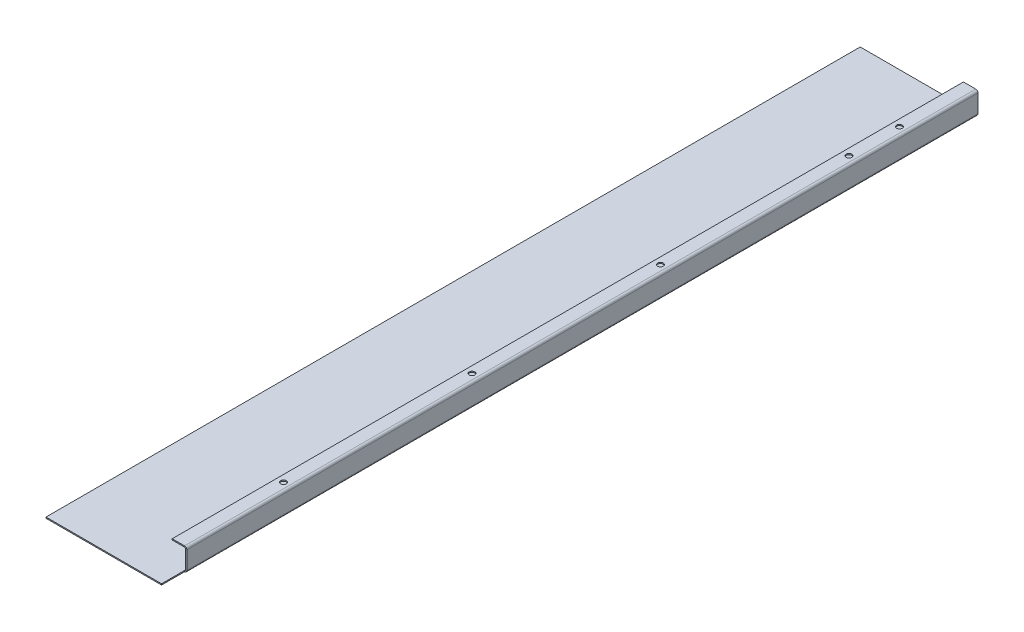
ISO-10303-21;
HEADER;
FILE_DESCRIPTION(('STEP AP214'),'2;1');
FILE_NAME('part.step','',(''),(''),'','','');
FILE_SCHEMA(('AUTOMOTIVE_DESIGN { 1 0 10303 214 1 1 1 1 }'));
ENDSEC;
DATA;
#1=APPLICATION_CONTEXT('core data for automotive mechanical design processes');
#2=APPLICATION_PROTOCOL_DEFINITION('international standard','automotive_design',2000,#1);
#3=PRODUCT_CONTEXT('',#1,'mechanical');
#4=PRODUCT('Part','Part','',(#3));
#5=PRODUCT_RELATED_PRODUCT_CATEGORY('part','',(#4));
#6=PRODUCT_DEFINITION_FORMATION('','',#4);
#7=PRODUCT_DEFINITION_CONTEXT('part definition',#1,'design');
#8=PRODUCT_DEFINITION('design','',#6,#7);
#9=PRODUCT_DEFINITION_SHAPE('','',#8);
#10=(LENGTH_UNIT() NAMED_UNIT(*) SI_UNIT(.MILLI.,.METRE.));
#11=(NAMED_UNIT(*) PLANE_ANGLE_UNIT() SI_UNIT($,.RADIAN.));
#12=(NAMED_UNIT(*) SI_UNIT($,.STERADIAN.) SOLID_ANGLE_UNIT());
#13=UNCERTAINTY_MEASURE_WITH_UNIT(LENGTH_MEASURE(1.E-05),#10,'distance_accuracy_value','');
#14=(GEOMETRIC_REPRESENTATION_CONTEXT(3) GLOBAL_UNCERTAINTY_ASSIGNED_CONTEXT((#13)) GLOBAL_UNIT_ASSIGNED_CONTEXT((#10,
#11,#12)) REPRESENTATION_CONTEXT('',''));
#15=CARTESIAN_POINT('',(0.,0.,0.));
#16=DIRECTION('',(0.,0.,1.));
#17=DIRECTION('',(1.,0.,0.));
#18=AXIS2_PLACEMENT_3D('',#15,#16,#17);
#19=CARTESIAN_POINT('',(105.,-3.86956670765295E-13,0.));
#20=DIRECTION('',(-1.,0.,0.));
#21=DIRECTION('',(0.,-1.,0.));
#22=AXIS2_PLACEMENT_3D('',#19,#20,#21);
#23=PLANE('',#22);
#24=DIRECTION('',(0.,-1.,0.));
#25=VECTOR('',#24,1.);
#26=CARTESIAN_POINT('',(105.,-3.87117238849561E-13,-20.5));
#27=LINE('',#26,#25);
#28=CARTESIAN_POINT('',(105.,17.,-20.5));
#29=VERTEX_POINT('',#28);
#30=CARTESIAN_POINT('',(105.,0.999999999999969,-20.5));
#31=VERTEX_POINT('',#30);
#32=EDGE_CURVE('E359',#29,#31,#27,.T.);
#33=ORIENTED_EDGE('',*,*,#32,.T.);
#34=DIRECTION('',(0.,0.,-1.));
#35=VECTOR('',#34,1.);
#36=CARTESIAN_POINT('',(105.,0.999999999999997,0.));
#37=LINE('',#36,#35);
#38=CARTESIAN_POINT('',(105.,0.999999999999969,-725.7));
#39=VERTEX_POINT('',#38);
#40=EDGE_CURVE('E237',#39,#31,#37,.F.);
#41=ORIENTED_EDGE('',*,*,#40,.F.);
#42=DIRECTION('',(0.,1.,0.));
#43=VECTOR('',#42,1.);
#44=CARTESIAN_POINT('',(105.,-3.86956670765295E-13,-725.7));
#45=LINE('',#44,#43);
#46=CARTESIAN_POINT('',(105.,17.,-725.7));
#47=VERTEX_POINT('',#46);
#48=EDGE_CURVE('E232',#39,#47,#45,.T.);
#49=ORIENTED_EDGE('',*,*,#48,.T.);
#50=DIRECTION('',(0.,0.,-1.));
#51=VECTOR('',#50,1.);
#52=CARTESIAN_POINT('',(105.,17.,-725.7));
#53=LINE('',#52,#51);
#54=EDGE_CURVE('E220',#47,#29,#53,.F.);
#55=ORIENTED_EDGE('',*,*,#54,.T.);
#56=EDGE_LOOP('',(#33,#41,#49,#55));
#57=FACE_BOUND('',#56,.T.);
#58=ADVANCED_FACE('F78',(#57),#23,.F.);
#59=CARTESIAN_POINT('',(104.,-3.83465189426452E-13,0.));
#60=DIRECTION('',(-1.,0.,0.));
#61=DIRECTION('',(0.,-1.,0.));
#62=AXIS2_PLACEMENT_3D('',#59,#60,#61);
#63=PLANE('',#62);
#64=DIRECTION('',(0.,0.,-1.));
#65=VECTOR('',#64,1.);
#66=CARTESIAN_POINT('',(104.,1.,0.));
#67=LINE('',#66,#65);
#68=CARTESIAN_POINT('',(104.,0.999999999999973,-20.5));
#69=VERTEX_POINT('',#68);
#70=CARTESIAN_POINT('',(104.,0.999999999999987,-725.7));
#71=VERTEX_POINT('',#70);
#72=EDGE_CURVE('E231',#69,#71,#67,.T.);
#73=ORIENTED_EDGE('',*,*,#72,.F.);
#74=DIRECTION('',(0.,-1.,0.));
#75=VECTOR('',#74,1.);
#76=CARTESIAN_POINT('',(104.,-3.83465189426452E-13,-20.5));
#77=LINE('',#76,#75);
#78=CARTESIAN_POINT('',(104.,17.,-20.5));
#79=VERTEX_POINT('',#78);
#80=EDGE_CURVE('E360',#79,#69,#77,.T.);
#81=ORIENTED_EDGE('',*,*,#80,.F.);
#82=DIRECTION('',(0.,0.,-1.));
#83=VECTOR('',#82,1.);
#84=CARTESIAN_POINT('',(104.,17.,-725.7));
#85=LINE('',#84,#83);
#86=CARTESIAN_POINT('',(104.,17.,-725.7));
#87=VERTEX_POINT('',#86);
#88=EDGE_CURVE('E103',#87,#79,#85,.F.);
#89=ORIENTED_EDGE('',*,*,#88,.F.);
#90=DIRECTION('',(0.,-1.,0.));
#91=VECTOR('',#90,1.);
#92=CARTESIAN_POINT('',(104.,19.,-725.7));
#93=LINE('',#92,#91);
#94=EDGE_CURVE('E235',#71,#87,#93,.F.);
#95=ORIENTED_EDGE('',*,*,#94,.F.);
#96=EDGE_LOOP('',(#73,#81,#89,#95));
#97=FACE_BOUND('',#96,.T.);
#98=ADVANCED_FACE('F377',(#97),#63,.T.);
#99=CARTESIAN_POINT('',(103.,0.999999999999991,-725.7));
#100=DIRECTION('',(0.,0.,-1.));
#101=DIRECTION('',(1.,0.,0.));
#102=AXIS2_PLACEMENT_3D('',#99,#100,#101);
#103=CYLINDRICAL_SURFACE('',#102,2.00000000000006);
#104=ORIENTED_EDGE('',*,*,#40,.T.);
#105=CARTESIAN_POINT('',(103.,0.999999999999934,-20.5000000000004));
#106=DIRECTION('',(0.,0.,-1.));
#107=DIRECTION('',(-1.,0.,0.));
#108=AXIS2_PLACEMENT_3D('',#105,#106,#107);
#109=CIRCLE('',#108,2.);
#110=CARTESIAN_POINT('',(103.,-1.00000000000007,-20.5000000000004));
#111=VERTEX_POINT('',#110);
#112=EDGE_CURVE('E332',#31,#111,#109,.T.);
#113=ORIENTED_EDGE('',*,*,#112,.T.);
#114=DIRECTION('',(0.,0.,-1.));
#115=VECTOR('',#114,1.);
#116=CARTESIAN_POINT('',(103.,-1.00000000000007,-725.7));
#117=LINE('',#116,#115);
#118=CARTESIAN_POINT('',(103.,-1.00000000000007,-725.7));
#119=VERTEX_POINT('',#118);
#120=EDGE_CURVE('E244',#119,#111,#117,.F.);
#121=ORIENTED_EDGE('',*,*,#120,.F.);
#122=CARTESIAN_POINT('',(103.,0.999999999999991,-725.7));
#123=DIRECTION('',(0.,0.,-1.));
#124=DIRECTION('',(-1.,0.,0.));
#125=AXIS2_PLACEMENT_3D('',#122,#123,#124);
#126=CIRCLE('',#125,2.00000000000006);
#127=EDGE_CURVE('E248',#39,#119,#126,.T.);
#128=ORIENTED_EDGE('',*,*,#127,.F.);
#129=EDGE_LOOP('',(#104,#113,#121,#128));
#130=FACE_BOUND('',#129,.T.);
#131=ADVANCED_FACE('F383',(#130),#103,.T.);
#132=CARTESIAN_POINT('',(103.,0.999999999999991,-725.7));
#133=DIRECTION('',(0.,0.,-1.));
#134=DIRECTION('',(1.,0.,0.));
#135=AXIS2_PLACEMENT_3D('',#132,#133,#134);
#136=CYLINDRICAL_SURFACE('',#135,1.00000000000006);
#137=CARTESIAN_POINT('',(103.,0.999999999999934,-20.5000000000009));
#138=DIRECTION('',(0.,0.,1.));
#139=DIRECTION('',(1.,0.,0.));
#140=AXIS2_PLACEMENT_3D('',#137,#138,#139);
#141=CIRCLE('',#140,1.);
#142=CARTESIAN_POINT('',(103.,0.,-20.5));
#143=VERTEX_POINT('',#142);
#144=EDGE_CURVE('E345',#69,#143,#141,.F.);
#145=ORIENTED_EDGE('',*,*,#144,.F.);
#146=ORIENTED_EDGE('',*,*,#72,.T.);
#147=CARTESIAN_POINT('',(103.,0.999999999999991,-725.7));
#148=DIRECTION('',(0.,0.,-1.));
#149=DIRECTION('',(-1.,0.,0.));
#150=AXIS2_PLACEMENT_3D('',#147,#148,#149);
#151=CIRCLE('',#150,1.00000000000006);
#152=CARTESIAN_POINT('',(103.,0.,-725.7));
#153=VERTEX_POINT('',#152);
#154=EDGE_CURVE('E234',#71,#153,#151,.T.);
#155=ORIENTED_EDGE('',*,*,#154,.T.);
#156=DIRECTION('',(0.,0.,-1.));
#157=VECTOR('',#156,1.);
#158=CARTESIAN_POINT('',(103.,0.,-725.7));
#159=LINE('',#158,#157);
#160=EDGE_CURVE('E251',#153,#143,#159,.F.);
#161=ORIENTED_EDGE('',*,*,#160,.T.);
#162=EDGE_LOOP('',(#145,#146,#155,#161));
#163=FACE_BOUND('',#162,.T.);
#164=ADVANCED_FACE('F390',(#163),#136,.F.);
#165=CARTESIAN_POINT('',(103.,17.,-725.7));
#166=DIRECTION('',(0.,0.,-1.));
#167=DIRECTION('',(0.,1.,0.));
#168=AXIS2_PLACEMENT_3D('',#165,#166,#167);
#169=CYLINDRICAL_SURFACE('',#168,2.);
#170=DIRECTION('',(0.,0.,-1.));
#171=VECTOR('',#170,1.);
#172=CARTESIAN_POINT('',(103.,19.,0.));
#173=LINE('',#172,#171);
#174=CARTESIAN_POINT('',(103.,19.,-725.7));
#175=VERTEX_POINT('',#174);
#176=CARTESIAN_POINT('',(103.,19.,-20.5));
#177=VERTEX_POINT('',#176);
#178=EDGE_CURVE('E200',#175,#177,#173,.F.);
#179=ORIENTED_EDGE('',*,*,#178,.T.);
#180=CARTESIAN_POINT('',(103.,17.,-20.5000000000004));
#181=DIRECTION('',(0.,0.,-1.));
#182=DIRECTION('',(-1.,0.,0.));
#183=AXIS2_PLACEMENT_3D('',#180,#181,#182);
#184=CIRCLE('',#183,2.);
#185=EDGE_CURVE('E184',#177,#29,#184,.T.);
#186=ORIENTED_EDGE('',*,*,#185,.T.);
#187=ORIENTED_EDGE('',*,*,#54,.F.);
#188=CARTESIAN_POINT('',(103.,17.,-725.7));
#189=DIRECTION('',(0.,0.,-1.));
#190=DIRECTION('',(-1.,0.,0.));
#191=AXIS2_PLACEMENT_3D('',#188,#189,#190);
#192=CIRCLE('',#191,2.);
#193=EDGE_CURVE('E208',#175,#47,#192,.T.);
#194=ORIENTED_EDGE('',*,*,#193,.F.);
#195=EDGE_LOOP('',(#179,#186,#187,#194));
#196=FACE_BOUND('',#195,.T.);
#197=ADVANCED_FACE('F206',(#196),#169,.T.);
#198=CARTESIAN_POINT('',(103.,17.,-725.7));
#199=DIRECTION('',(0.,0.,-1.));
#200=DIRECTION('',(0.,1.,0.));
#201=AXIS2_PLACEMENT_3D('',#198,#199,#200);
#202=CYLINDRICAL_SURFACE('',#201,1.);
#203=CARTESIAN_POINT('',(103.,17.,-20.5000000000009));
#204=DIRECTION('',(0.,0.,1.));
#205=DIRECTION('',(1.,0.,0.));
#206=AXIS2_PLACEMENT_3D('',#203,#204,#205);
#207=CIRCLE('',#206,1.);
#208=CARTESIAN_POINT('',(103.,18.,-20.5));
#209=VERTEX_POINT('',#208);
#210=EDGE_CURVE('E194',#209,#79,#207,.F.);
#211=ORIENTED_EDGE('',*,*,#210,.F.);
#212=DIRECTION('',(0.,0.,-1.));
#213=VECTOR('',#212,1.);
#214=CARTESIAN_POINT('',(103.,18.,0.));
#215=LINE('',#214,#213);
#216=CARTESIAN_POINT('',(103.,18.,-725.7));
#217=VERTEX_POINT('',#216);
#218=EDGE_CURVE('E215',#209,#217,#215,.T.);
#219=ORIENTED_EDGE('',*,*,#218,.T.);
#220=CARTESIAN_POINT('',(103.,17.,-725.7));
#221=DIRECTION('',(0.,0.,-1.));
#222=DIRECTION('',(-1.,0.,0.));
#223=AXIS2_PLACEMENT_3D('',#220,#221,#222);
#224=CIRCLE('',#223,1.);
#225=EDGE_CURVE('E225',#217,#87,#224,.T.);
#226=ORIENTED_EDGE('',*,*,#225,.T.);
#227=ORIENTED_EDGE('',*,*,#88,.T.);
#228=EDGE_LOOP('',(#211,#219,#226,#227));
#229=FACE_BOUND('',#228,.T.);
#230=ADVANCED_FACE('F314',(#229),#202,.F.);
#231=CARTESIAN_POINT('',(1.40823756520346E-13,19.0000000000008,0.));
#232=DIRECTION('',(0.,-1.,0.));
#233=DIRECTION('',(1.,0.,0.));
#234=AXIS2_PLACEMENT_3D('',#231,#232,#233);
#235=PLANE('',#234);
#236=CARTESIAN_POINT('',(98.0000000000124,19.,-113.7));
#237=DIRECTION('',(0.,1.,0.));
#238=DIRECTION('',(-1.,0.,0.));
#239=AXIS2_PLACEMENT_3D('',#236,#237,#238);
#240=CIRCLE('',#239,2.50000000000001);
#241=CARTESIAN_POINT('',(95.5000000000124,19.0000000000001,-113.7));
#242=VERTEX_POINT('',#241);
#243=EDGE_CURVE('E328',#242,#242,#240,.T.);
#244=ORIENTED_EDGE('',*,*,#243,.F.);
#245=EDGE_LOOP('',(#244));
#246=FACE_BOUND('',#245,.T.);
#247=CARTESIAN_POINT('',(98.0000000000083,19.,-281.7));
#248=DIRECTION('',(0.,1.,0.));
#249=DIRECTION('',(-1.,0.,0.));
#250=AXIS2_PLACEMENT_3D('',#247,#248,#249);
#251=CIRCLE('',#250,2.50000000000001);
#252=CARTESIAN_POINT('',(95.5000000000083,19.0000000000001,-281.7));
#253=VERTEX_POINT('',#252);
#254=EDGE_CURVE('E331',#253,#253,#251,.T.);
#255=ORIENTED_EDGE('',*,*,#254,.F.);
#256=EDGE_LOOP('',(#255));
#257=FACE_BOUND('',#256,.T.);
#258=CARTESIAN_POINT('',(98.0000000000041,19.,-449.7));
#259=DIRECTION('',(0.,1.,0.));
#260=DIRECTION('',(-1.,0.,0.));
#261=AXIS2_PLACEMENT_3D('',#258,#259,#260);
#262=CIRCLE('',#261,2.5);
#263=CARTESIAN_POINT('',(95.5000000000041,19.0000000000001,-449.7));
#264=VERTEX_POINT('',#263);
#265=EDGE_CURVE('E335',#264,#264,#262,.T.);
#266=ORIENTED_EDGE('',*,*,#265,.F.);
#267=EDGE_LOOP('',(#266));
#268=FACE_BOUND('',#267,.T.);
#269=CARTESIAN_POINT('',(98.,19.,-617.7));
#270=DIRECTION('',(0.,1.,0.));
#271=DIRECTION('',(-1.,0.,0.));
#272=AXIS2_PLACEMENT_3D('',#269,#270,#271);
#273=CIRCLE('',#272,2.50000000000001);
#274=CARTESIAN_POINT('',(95.5,19.0000000000001,-617.7));
#275=VERTEX_POINT('',#274);
#276=EDGE_CURVE('E338',#275,#275,#273,.T.);
#277=ORIENTED_EDGE('',*,*,#276,.F.);
#278=EDGE_LOOP('',(#277));
#279=FACE_BOUND('',#278,.T.);
#280=CARTESIAN_POINT('',(98.,19.,-662.7));
#281=DIRECTION('',(0.,1.,0.));
#282=DIRECTION('',(-1.,0.,0.));
#283=AXIS2_PLACEMENT_3D('',#280,#281,#282);
#284=CIRCLE('',#283,2.5);
#285=CARTESIAN_POINT('',(95.5,19.0000000000001,-662.7));
#286=VERTEX_POINT('',#285);
#287=EDGE_CURVE('E281',#286,#286,#284,.T.);
#288=ORIENTED_EDGE('',*,*,#287,.F.);
#289=EDGE_LOOP('',(#288));
#290=FACE_BOUND('',#289,.T.);
#291=DIRECTION('',(1.,0.,0.));
#292=VECTOR('',#291,1.);
#293=CARTESIAN_POINT('',(1.4090824024163E-13,19.0000000000008,-20.5));
#294=LINE('',#293,#292);
#295=CARTESIAN_POINT('',(92.0000000000001,19.0000000000001,-20.5));
#296=VERTEX_POINT('',#295);
#297=EDGE_CURVE('E95',#296,#177,#294,.T.);
#298=ORIENTED_EDGE('',*,*,#297,.T.);
#299=ORIENTED_EDGE('',*,*,#178,.F.);
#300=DIRECTION('',(-1.,0.,0.));
#301=VECTOR('',#300,1.);
#302=CARTESIAN_POINT('',(1.40823756520346E-13,19.0000000000008,-725.7));
#303=LINE('',#302,#301);
#304=CARTESIAN_POINT('',(92.,19.0000000000001,-725.7));
#305=VERTEX_POINT('',#304);
#306=EDGE_CURVE('E322',#175,#305,#303,.T.);
#307=ORIENTED_EDGE('',*,*,#306,.T.);
#308=DIRECTION('',(0.,0.,1.));
#309=VECTOR('',#308,1.);
#310=CARTESIAN_POINT('',(92.0000000000001,19.0000000000001,0.));
#311=LINE('',#310,#309);
#312=EDGE_CURVE('E203',#305,#296,#311,.T.);
#313=ORIENTED_EDGE('',*,*,#312,.T.);
#314=EDGE_LOOP('',(#298,#299,#307,#313));
#315=FACE_BOUND('',#314,.T.);
#316=ADVANCED_FACE('F199',(#246,#257,#268,#279,#290,#315),#235,.F.);
#317=CARTESIAN_POINT('',(1.33680225758394E-13,18.0000000000008,0.));
#318=DIRECTION('',(0.,-1.,0.));
#319=DIRECTION('',(1.,0.,0.));
#320=AXIS2_PLACEMENT_3D('',#317,#318,#319);
#321=PLANE('',#320);
#322=CARTESIAN_POINT('',(98.,18.,-662.7));
#323=DIRECTION('',(0.,-1.,0.));
#324=DIRECTION('',(1.,0.,0.));
#325=AXIS2_PLACEMENT_3D('',#322,#323,#324);
#326=CIRCLE('',#325,2.5);
#327=CARTESIAN_POINT('',(100.5,18.,-662.7));
#328=VERTEX_POINT('',#327);
#329=EDGE_CURVE('E82',#328,#328,#326,.T.);
#330=ORIENTED_EDGE('',*,*,#329,.F.);
#331=EDGE_LOOP('',(#330));
#332=FACE_BOUND('',#331,.T.);
#333=CARTESIAN_POINT('',(98.,18.,-617.7));
#334=DIRECTION('',(0.,-1.,0.));
#335=DIRECTION('',(1.,0.,0.));
#336=AXIS2_PLACEMENT_3D('',#333,#334,#335);
#337=CIRCLE('',#336,2.50000000000001);
#338=CARTESIAN_POINT('',(100.5,18.,-617.7));
#339=VERTEX_POINT('',#338);
#340=EDGE_CURVE('E286',#339,#339,#337,.T.);
#341=ORIENTED_EDGE('',*,*,#340,.F.);
#342=EDGE_LOOP('',(#341));
#343=FACE_BOUND('',#342,.T.);
#344=CARTESIAN_POINT('',(98.0000000000041,18.,-449.7));
#345=DIRECTION('',(0.,-1.,0.));
#346=DIRECTION('',(1.,0.,0.));
#347=AXIS2_PLACEMENT_3D('',#344,#345,#346);
#348=CIRCLE('',#347,2.5);
#349=CARTESIAN_POINT('',(100.500000000004,18.,-449.7));
#350=VERTEX_POINT('',#349);
#351=EDGE_CURVE('E284',#350,#350,#348,.T.);
#352=ORIENTED_EDGE('',*,*,#351,.F.);
#353=EDGE_LOOP('',(#352));
#354=FACE_BOUND('',#353,.T.);
#355=CARTESIAN_POINT('',(98.0000000000083,18.,-281.7));
#356=DIRECTION('',(0.,-1.,0.));
#357=DIRECTION('',(1.,0.,0.));
#358=AXIS2_PLACEMENT_3D('',#355,#356,#357);
#359=CIRCLE('',#358,2.50000000000001);
#360=CARTESIAN_POINT('',(100.500000000008,18.,-281.7));
#361=VERTEX_POINT('',#360);
#362=EDGE_CURVE('E280',#361,#361,#359,.T.);
#363=ORIENTED_EDGE('',*,*,#362,.F.);
#364=EDGE_LOOP('',(#363));
#365=FACE_BOUND('',#364,.T.);
#366=CARTESIAN_POINT('',(98.0000000000124,18.,-113.7));
#367=DIRECTION('',(0.,-1.,0.));
#368=DIRECTION('',(1.,0.,0.));
#369=AXIS2_PLACEMENT_3D('',#366,#367,#368);
#370=CIRCLE('',#369,2.50000000000001);
#371=CARTESIAN_POINT('',(100.500000000012,18.,-113.7));
#372=VERTEX_POINT('',#371);
#373=EDGE_CURVE('E277',#372,#372,#370,.T.);
#374=ORIENTED_EDGE('',*,*,#373,.F.);
#375=EDGE_LOOP('',(#374));
#376=FACE_BOUND('',#375,.T.);
#377=ORIENTED_EDGE('',*,*,#218,.F.);
#378=DIRECTION('',(1.,0.,0.));
#379=VECTOR('',#378,1.);
#380=CARTESIAN_POINT('',(1.30156829789573E-13,18.0000000000008,-20.5));
#381=LINE('',#380,#379);
#382=CARTESIAN_POINT('',(92.0000000000001,18.0000000000001,-20.5));
#383=VERTEX_POINT('',#382);
#384=EDGE_CURVE('E179',#383,#209,#381,.T.);
#385=ORIENTED_EDGE('',*,*,#384,.F.);
#386=DIRECTION('',(0.,0.,-1.));
#387=VECTOR('',#386,1.);
#388=CARTESIAN_POINT('',(92.0000000000001,18.0000000000001,0.));
#389=LINE('',#388,#387);
#390=CARTESIAN_POINT('',(92.,18.0000000000001,-725.7));
#391=VERTEX_POINT('',#390);
#392=EDGE_CURVE('E213',#391,#383,#389,.F.);
#393=ORIENTED_EDGE('',*,*,#392,.F.);
#394=DIRECTION('',(1.,0.,0.));
#395=VECTOR('',#394,1.);
#396=CARTESIAN_POINT('',(92.,18.0000000000001,-725.7));
#397=LINE('',#396,#395);
#398=EDGE_CURVE('E210',#217,#391,#397,.F.);
#399=ORIENTED_EDGE('',*,*,#398,.F.);
#400=EDGE_LOOP('',(#377,#385,#393,#399));
#401=FACE_BOUND('',#400,.T.);
#402=ADVANCED_FACE('F296',(#332,#343,#354,#365,#376,#401),#321,.T.);
#403=CARTESIAN_POINT('',(92.0000000000001,19.0000000000001,0.));
#404=DIRECTION('',(1.,0.,0.));
#405=DIRECTION('',(0.,1.,0.));
#406=AXIS2_PLACEMENT_3D('',#403,#404,#405);
#407=PLANE('',#406);
#408=DIRECTION('',(0.,-1.,0.));
#409=VECTOR('',#408,1.);
#410=CARTESIAN_POINT('',(92.0000000000001,18.0000000000001,-20.5));
#411=LINE('',#410,#409);
#412=EDGE_CURVE('E204',#383,#296,#411,.F.);
#413=ORIENTED_EDGE('',*,*,#412,.T.);
#414=ORIENTED_EDGE('',*,*,#312,.F.);
#415=DIRECTION('',(0.,-1.,0.));
#416=VECTOR('',#415,1.);
#417=CARTESIAN_POINT('',(92.,19.0000000000001,-725.7));
#418=LINE('',#417,#416);
#419=EDGE_CURVE('E228',#305,#391,#418,.T.);
#420=ORIENTED_EDGE('',*,*,#419,.T.);
#421=ORIENTED_EDGE('',*,*,#392,.T.);
#422=EDGE_LOOP('',(#413,#414,#420,#421));
#423=FACE_BOUND('',#422,.T.);
#424=ADVANCED_FACE('F299',(#423),#407,.F.);
#425=CARTESIAN_POINT('',(105.,19.,-725.7));
#426=DIRECTION('',(0.,0.,1.));
#427=DIRECTION('',(1.,0.,0.));
#428=AXIS2_PLACEMENT_3D('',#425,#426,#427);
#429=PLANE('',#428);
#430=DIRECTION('',(1.,0.,0.));
#431=VECTOR('',#430,1.);
#432=CARTESIAN_POINT('',(104.,17.,-725.7));
#433=LINE('',#432,#431);
#434=EDGE_CURVE('E222',#87,#47,#433,.T.);
#435=ORIENTED_EDGE('',*,*,#434,.T.);
#436=ORIENTED_EDGE('',*,*,#48,.F.);
#437=DIRECTION('',(-1.,0.,0.));
#438=VECTOR('',#437,1.);
#439=CARTESIAN_POINT('',(104.,0.999999999999973,-725.7));
#440=LINE('',#439,#438);
#441=EDGE_CURVE('E240',#71,#39,#440,.F.);
#442=ORIENTED_EDGE('',*,*,#441,.F.);
#443=ORIENTED_EDGE('',*,*,#94,.T.);
#444=EDGE_LOOP('',(#435,#436,#442,#443));
#445=FACE_BOUND('',#444,.T.);
#446=ADVANCED_FACE('F367',(#445),#429,.F.);
#447=CARTESIAN_POINT('',(-1.11022302462516E-13,-1.,-725.7));
#448=DIRECTION('',(0.,0.,-1.));
#449=DIRECTION('',(-1.,0.,0.));
#450=AXIS2_PLACEMENT_3D('',#447,#448,#449);
#451=PLANE('',#450);
#452=DIRECTION('',(-1.,0.,0.));
#453=VECTOR('',#452,1.);
#454=CARTESIAN_POINT('',(-1.11022302462516E-13,0.,-725.7));
#455=LINE('',#454,#453);
#456=CARTESIAN_POINT('',(-1.11022302462516E-13,0.,-725.7));
#457=VERTEX_POINT('',#456);
#458=EDGE_CURVE('E265',#153,#457,#455,.T.);
#459=ORIENTED_EDGE('',*,*,#458,.F.);
#460=DIRECTION('',(0.,-1.,0.));
#461=VECTOR('',#460,1.);
#462=CARTESIAN_POINT('',(103.,0.,-725.7));
#463=LINE('',#462,#461);
#464=EDGE_CURVE('E247',#153,#119,#463,.T.);
#465=ORIENTED_EDGE('',*,*,#464,.T.);
#466=DIRECTION('',(-1.,0.,0.));
#467=VECTOR('',#466,1.);
#468=CARTESIAN_POINT('',(-1.11022302462516E-13,-1.,-725.7));
#469=LINE('',#468,#467);
#470=CARTESIAN_POINT('',(-1.11022302462516E-13,-1.,-725.7));
#471=VERTEX_POINT('',#470);
#472=EDGE_CURVE('E268',#119,#471,#469,.T.);
#473=ORIENTED_EDGE('',*,*,#472,.T.);
#474=DIRECTION('',(0.,1.,0.));
#475=VECTOR('',#474,1.);
#476=CARTESIAN_POINT('',(-1.11022302462516E-13,-1.,-725.7));
#477=LINE('',#476,#475);
#478=EDGE_CURVE('E13',#471,#457,#477,.T.);
#479=ORIENTED_EDGE('',*,*,#478,.T.);
#480=EDGE_LOOP('',(#459,#465,#473,#479));
#481=FACE_BOUND('',#480,.T.);
#482=ADVANCED_FACE('F372',(#481),#451,.T.);
#483=CARTESIAN_POINT('',(0.,-1.,0.));
#484=DIRECTION('',(0.,-1.,0.));
#485=DIRECTION('',(0.,0.,-1.));
#486=AXIS2_PLACEMENT_3D('',#483,#484,#485);
#487=PLANE('',#486);
#488=ORIENTED_EDGE('',*,*,#472,.F.);
#489=ORIENTED_EDGE('',*,*,#120,.T.);
#490=DIRECTION('',(0.,0.,-1.));
#491=VECTOR('',#490,1.);
#492=CARTESIAN_POINT('',(103.,-1.00000000000007,-725.7));
#493=LINE('',#492,#491);
#494=CARTESIAN_POINT('',(103.,-1.00000000000007,0.));
#495=VERTEX_POINT('',#494);
#496=EDGE_CURVE('E350',#111,#495,#493,.F.);
#497=ORIENTED_EDGE('',*,*,#496,.T.);
#498=DIRECTION('',(1.,0.,0.));
#499=VECTOR('',#498,1.);
#500=CARTESIAN_POINT('',(0.,-1.,0.));
#501=LINE('',#500,#499);
#502=CARTESIAN_POINT('',(0.,-1.,0.));
#503=VERTEX_POINT('',#502);
#504=EDGE_CURVE('E264',#503,#495,#501,.T.);
#505=ORIENTED_EDGE('',*,*,#504,.F.);
#506=DIRECTION('',(0.,0.,1.));
#507=VECTOR('',#506,1.);
#508=CARTESIAN_POINT('',(0.,-1.,0.));
#509=LINE('',#508,#507);
#510=EDGE_CURVE('E261',#471,#503,#509,.T.);
#511=ORIENTED_EDGE('',*,*,#510,.F.);
#512=EDGE_LOOP('',(#488,#489,#497,#505,#511));
#513=FACE_BOUND('',#512,.T.);
#514=ADVANCED_FACE('F400',(#513),#487,.T.);
#515=CARTESIAN_POINT('',(0.,0.,0.));
#516=DIRECTION('',(0.,-1.,0.));
#517=DIRECTION('',(0.,0.,-1.));
#518=AXIS2_PLACEMENT_3D('',#515,#516,#517);
#519=PLANE('',#518);
#520=ORIENTED_EDGE('',*,*,#160,.F.);
#521=ORIENTED_EDGE('',*,*,#458,.T.);
#522=DIRECTION('',(0.,0.,1.));
#523=VECTOR('',#522,1.);
#524=CARTESIAN_POINT('',(0.,0.,0.));
#525=LINE('',#524,#523);
#526=CARTESIAN_POINT('',(0.,0.,0.));
#527=VERTEX_POINT('',#526);
#528=EDGE_CURVE('E258',#457,#527,#525,.T.);
#529=ORIENTED_EDGE('',*,*,#528,.T.);
#530=DIRECTION('',(1.,0.,0.));
#531=VECTOR('',#530,1.);
#532=CARTESIAN_POINT('',(0.,0.,0.));
#533=LINE('',#532,#531);
#534=CARTESIAN_POINT('',(103.,0.,0.));
#535=VERTEX_POINT('',#534);
#536=EDGE_CURVE('E272',#527,#535,#533,.T.);
#537=ORIENTED_EDGE('',*,*,#536,.T.);
#538=DIRECTION('',(0.,0.,-1.));
#539=VECTOR('',#538,1.);
#540=CARTESIAN_POINT('',(103.,0.,-725.7));
#541=LINE('',#540,#539);
#542=EDGE_CURVE('E353',#143,#535,#541,.F.);
#543=ORIENTED_EDGE('',*,*,#542,.F.);
#544=EDGE_LOOP('',(#520,#521,#529,#537,#543));
#545=FACE_BOUND('',#544,.T.);
#546=ADVANCED_FACE('F403',(#545),#519,.F.);
#547=CARTESIAN_POINT('',(0.,-1.,0.));
#548=DIRECTION('',(-1.,0.,0.));
#549=DIRECTION('',(0.,0.,1.));
#550=AXIS2_PLACEMENT_3D('',#547,#548,#549);
#551=PLANE('',#550);
#552=ORIENTED_EDGE('',*,*,#528,.F.);
#553=ORIENTED_EDGE('',*,*,#478,.F.);
#554=ORIENTED_EDGE('',*,*,#510,.T.);
#555=DIRECTION('',(0.,1.,0.));
#556=VECTOR('',#555,1.);
#557=CARTESIAN_POINT('',(0.,-1.,0.));
#558=LINE('',#557,#556);
#559=EDGE_CURVE('E87',#503,#527,#558,.T.);
#560=ORIENTED_EDGE('',*,*,#559,.T.);
#561=EDGE_LOOP('',(#552,#553,#554,#560));
#562=FACE_BOUND('',#561,.T.);
#563=ADVANCED_FACE('F80',(#562),#551,.T.);
#564=CARTESIAN_POINT('',(0.,-1.,0.));
#565=DIRECTION('',(0.,0.,1.));
#566=DIRECTION('',(1.,0.,0.));
#567=AXIS2_PLACEMENT_3D('',#564,#565,#566);
#568=PLANE('',#567);
#569=DIRECTION('',(0.,-1.,0.));
#570=VECTOR('',#569,1.);
#571=CARTESIAN_POINT('',(103.,0.,0.));
#572=LINE('',#571,#570);
#573=EDGE_CURVE('E256',#535,#495,#572,.T.);
#574=ORIENTED_EDGE('',*,*,#573,.F.);
#575=ORIENTED_EDGE('',*,*,#536,.F.);
#576=ORIENTED_EDGE('',*,*,#559,.F.);
#577=ORIENTED_EDGE('',*,*,#504,.T.);
#578=EDGE_LOOP('',(#574,#575,#576,#577));
#579=FACE_BOUND('',#578,.T.);
#580=ADVANCED_FACE('F398',(#579),#568,.T.);
#581=CARTESIAN_POINT('',(103.,0.999999999999991,-725.7));
#582=DIRECTION('',(0.,0.,1.));
#583=DIRECTION('',(1.,0.,0.));
#584=AXIS2_PLACEMENT_3D('',#581,#582,#583);
#585=PLANE('',#584);
#586=ORIENTED_EDGE('',*,*,#154,.F.);
#587=ORIENTED_EDGE('',*,*,#441,.T.);
#588=ORIENTED_EDGE('',*,*,#127,.T.);
#589=ORIENTED_EDGE('',*,*,#464,.F.);
#590=EDGE_LOOP('',(#586,#587,#588,#589));
#591=FACE_BOUND('',#590,.T.);
#592=ADVANCED_FACE('F395',(#591),#585,.F.);
#593=CARTESIAN_POINT('',(103.,17.,-725.7));
#594=DIRECTION('',(0.,0.,1.));
#595=DIRECTION('',(1.,0.,0.));
#596=AXIS2_PLACEMENT_3D('',#593,#594,#595);
#597=PLANE('',#596);
#598=ORIENTED_EDGE('',*,*,#225,.F.);
#599=DIRECTION('',(0.,-1.,0.));
#600=VECTOR('',#599,1.);
#601=CARTESIAN_POINT('',(103.,18.,-725.7));
#602=LINE('',#601,#600);
#603=EDGE_CURVE('E211',#217,#175,#602,.F.);
#604=ORIENTED_EDGE('',*,*,#603,.T.);
#605=ORIENTED_EDGE('',*,*,#193,.T.);
#606=ORIENTED_EDGE('',*,*,#434,.F.);
#607=EDGE_LOOP('',(#598,#604,#605,#606));
#608=FACE_BOUND('',#607,.T.);
#609=ADVANCED_FACE('F318',(#608),#597,.F.);
#610=CARTESIAN_POINT('',(92.,19.0000000000001,-725.7));
#611=DIRECTION('',(0.,0.,1.));
#612=DIRECTION('',(0.,-1.,0.));
#613=AXIS2_PLACEMENT_3D('',#610,#611,#612);
#614=PLANE('',#613);
#615=ORIENTED_EDGE('',*,*,#603,.F.);
#616=ORIENTED_EDGE('',*,*,#398,.T.);
#617=ORIENTED_EDGE('',*,*,#419,.F.);
#618=ORIENTED_EDGE('',*,*,#306,.F.);
#619=EDGE_LOOP('',(#615,#616,#617,#618));
#620=FACE_BOUND('',#619,.T.);
#621=ADVANCED_FACE('F320',(#620),#614,.F.);
#622=CARTESIAN_POINT('',(98.0000000000123,9.00000000000004,-113.7));
#623=DIRECTION('',(0.,1.,0.));
#624=DIRECTION('',(-1.,0.,0.));
#625=AXIS2_PLACEMENT_3D('',#622,#623,#624);
#626=CYLINDRICAL_SURFACE('',#625,2.50000000000001);
#627=ORIENTED_EDGE('',*,*,#373,.T.);
#628=EDGE_LOOP('',(#627));
#629=FACE_BOUND('',#628,.T.);
#630=ORIENTED_EDGE('',*,*,#243,.T.);
#631=EDGE_LOOP('',(#630));
#632=FACE_BOUND('',#631,.T.);
#633=ADVANCED_FACE('F460',(#629,#632),#626,.F.);
#634=CARTESIAN_POINT('',(98.0000000000082,9.00000000000004,-281.7));
#635=DIRECTION('',(0.,1.,0.));
#636=DIRECTION('',(-1.,0.,0.));
#637=AXIS2_PLACEMENT_3D('',#634,#635,#636);
#638=CYLINDRICAL_SURFACE('',#637,2.50000000000001);
#639=ORIENTED_EDGE('',*,*,#362,.T.);
#640=EDGE_LOOP('',(#639));
#641=FACE_BOUND('',#640,.T.);
#642=ORIENTED_EDGE('',*,*,#254,.T.);
#643=EDGE_LOOP('',(#642));
#644=FACE_BOUND('',#643,.T.);
#645=ADVANCED_FACE('F456',(#641,#644),#638,.F.);
#646=CARTESIAN_POINT('',(98.0000000000041,9.00000000000004,-449.7));
#647=DIRECTION('',(0.,1.,0.));
#648=DIRECTION('',(-1.,0.,0.));
#649=AXIS2_PLACEMENT_3D('',#646,#647,#648);
#650=CYLINDRICAL_SURFACE('',#649,2.5);
#651=ORIENTED_EDGE('',*,*,#351,.T.);
#652=EDGE_LOOP('',(#651));
#653=FACE_BOUND('',#652,.T.);
#654=ORIENTED_EDGE('',*,*,#265,.T.);
#655=EDGE_LOOP('',(#654));
#656=FACE_BOUND('',#655,.T.);
#657=ADVANCED_FACE('F453',(#653,#656),#650,.F.);
#658=CARTESIAN_POINT('',(97.9999999999999,9.00000000000004,-617.7));
#659=DIRECTION('',(0.,1.,0.));
#660=DIRECTION('',(-1.,0.,0.));
#661=AXIS2_PLACEMENT_3D('',#658,#659,#660);
#662=CYLINDRICAL_SURFACE('',#661,2.50000000000001);
#663=ORIENTED_EDGE('',*,*,#340,.T.);
#664=EDGE_LOOP('',(#663));
#665=FACE_BOUND('',#664,.T.);
#666=ORIENTED_EDGE('',*,*,#276,.T.);
#667=EDGE_LOOP('',(#666));
#668=FACE_BOUND('',#667,.T.);
#669=ADVANCED_FACE('F447',(#665,#668),#662,.F.);
#670=CARTESIAN_POINT('',(97.9999999999999,9.00000000000004,-662.7));
#671=DIRECTION('',(0.,1.,0.));
#672=DIRECTION('',(-1.,0.,0.));
#673=AXIS2_PLACEMENT_3D('',#670,#671,#672);
#674=CYLINDRICAL_SURFACE('',#673,2.5);
#675=ORIENTED_EDGE('',*,*,#329,.T.);
#676=EDGE_LOOP('',(#675));
#677=FACE_BOUND('',#676,.T.);
#678=ORIENTED_EDGE('',*,*,#287,.T.);
#679=EDGE_LOOP('',(#678));
#680=FACE_BOUND('',#679,.T.);
#681=ADVANCED_FACE('F293',(#677,#680),#674,.F.);
#682=CARTESIAN_POINT('',(103.,0.999999999999934,-20.5000000000004));
#683=DIRECTION('',(0.,0.,1.));
#684=DIRECTION('',(1.,0.,0.));
#685=AXIS2_PLACEMENT_3D('',#682,#683,#684);
#686=PLANE('',#685);
#687=DIRECTION('',(-1.,0.,0.));
#688=VECTOR('',#687,1.);
#689=CARTESIAN_POINT('',(105.,0.999999999999807,-20.5));
#690=LINE('',#689,#688);
#691=EDGE_CURVE('E183',#31,#69,#690,.T.);
#692=ORIENTED_EDGE('',*,*,#691,.T.);
#693=ORIENTED_EDGE('',*,*,#144,.T.);
#694=DIRECTION('',(0.,-1.,0.));
#695=VECTOR('',#694,1.);
#696=CARTESIAN_POINT('',(103.,-3.76161090580234E-13,-20.5));
#697=LINE('',#696,#695);
#698=EDGE_CURVE('E348',#143,#111,#697,.T.);
#699=ORIENTED_EDGE('',*,*,#698,.T.);
#700=ORIENTED_EDGE('',*,*,#112,.F.);
#701=EDGE_LOOP('',(#692,#693,#699,#700));
#702=FACE_BOUND('',#701,.T.);
#703=ADVANCED_FACE('F439',(#702),#686,.T.);
#704=CARTESIAN_POINT('',(103.,0.,-10.25));
#705=DIRECTION('',(-1.,0.,0.));
#706=DIRECTION('',(0.,0.,-1.));
#707=AXIS2_PLACEMENT_3D('',#704,#705,#706);
#708=PLANE('',#707);
#709=ORIENTED_EDGE('',*,*,#542,.T.);
#710=ORIENTED_EDGE('',*,*,#573,.T.);
#711=ORIENTED_EDGE('',*,*,#496,.F.);
#712=ORIENTED_EDGE('',*,*,#698,.F.);
#713=EDGE_LOOP('',(#709,#710,#711,#712));
#714=FACE_BOUND('',#713,.T.);
#715=ADVANCED_FACE('F421',(#714),#708,.F.);
#716=CARTESIAN_POINT('',(103.,17.,-20.5000000000004));
#717=DIRECTION('',(0.,0.,1.));
#718=DIRECTION('',(1.,0.,0.));
#719=AXIS2_PLACEMENT_3D('',#716,#717,#718);
#720=PLANE('',#719);
#721=ORIENTED_EDGE('',*,*,#210,.T.);
#722=DIRECTION('',(1.,0.,0.));
#723=VECTOR('',#722,1.);
#724=CARTESIAN_POINT('',(104.,17.,-20.5));
#725=LINE('',#724,#723);
#726=EDGE_CURVE('E189',#79,#29,#725,.T.);
#727=ORIENTED_EDGE('',*,*,#726,.T.);
#728=ORIENTED_EDGE('',*,*,#185,.F.);
#729=DIRECTION('',(0.,1.,0.));
#730=VECTOR('',#729,1.);
#731=CARTESIAN_POINT('',(103.,17.9999999999999,-20.5));
#732=LINE('',#731,#730);
#733=EDGE_CURVE('E175',#209,#177,#732,.T.);
#734=ORIENTED_EDGE('',*,*,#733,.F.);
#735=EDGE_LOOP('',(#721,#727,#728,#734));
#736=FACE_BOUND('',#735,.T.);
#737=ADVANCED_FACE('F188',(#736),#720,.T.);
#738=CARTESIAN_POINT('',(104.,-3.83465189426452E-13,-20.5));
#739=DIRECTION('',(0.,0.,-1.));
#740=DIRECTION('',(0.,-1.,0.));
#741=AXIS2_PLACEMENT_3D('',#738,#739,#740);
#742=PLANE('',#741);
#743=ORIENTED_EDGE('',*,*,#80,.T.);
#744=ORIENTED_EDGE('',*,*,#691,.F.);
#745=ORIENTED_EDGE('',*,*,#32,.F.);
#746=ORIENTED_EDGE('',*,*,#726,.F.);
#747=EDGE_LOOP('',(#743,#744,#745,#746));
#748=FACE_BOUND('',#747,.T.);
#749=ADVANCED_FACE('F437',(#748),#742,.F.);
#750=CARTESIAN_POINT('',(1.30156829789573E-13,18.0000000000008,-20.5));
#751=DIRECTION('',(0.,0.,-1.));
#752=DIRECTION('',(1.,0.,0.));
#753=AXIS2_PLACEMENT_3D('',#750,#751,#752);
#754=PLANE('',#753);
#755=ORIENTED_EDGE('',*,*,#384,.T.);
#756=ORIENTED_EDGE('',*,*,#733,.T.);
#757=ORIENTED_EDGE('',*,*,#297,.F.);
#758=ORIENTED_EDGE('',*,*,#412,.F.);
#759=EDGE_LOOP('',(#755,#756,#757,#758));
#760=FACE_BOUND('',#759,.T.);
#761=ADVANCED_FACE('F177',(#760),#754,.F.);
#762=CLOSED_SHELL('',(#58,#98,#131,#164,#197,#230,#316,#402,#424,#446,#482,#514,#546,#563,#580,
#592,#609,#621,#633,#645,#657,#669,#681,#703,#715,#737,#749,#761));
#763=MANIFOLD_SOLID_BREP('B2',#762);
#764=ADVANCED_BREP_SHAPE_REPRESENTATION('',(#18,#763),#14);
#765=SHAPE_DEFINITION_REPRESENTATION(#9,#764);
ENDSEC;
END-ISO-10303-21;
